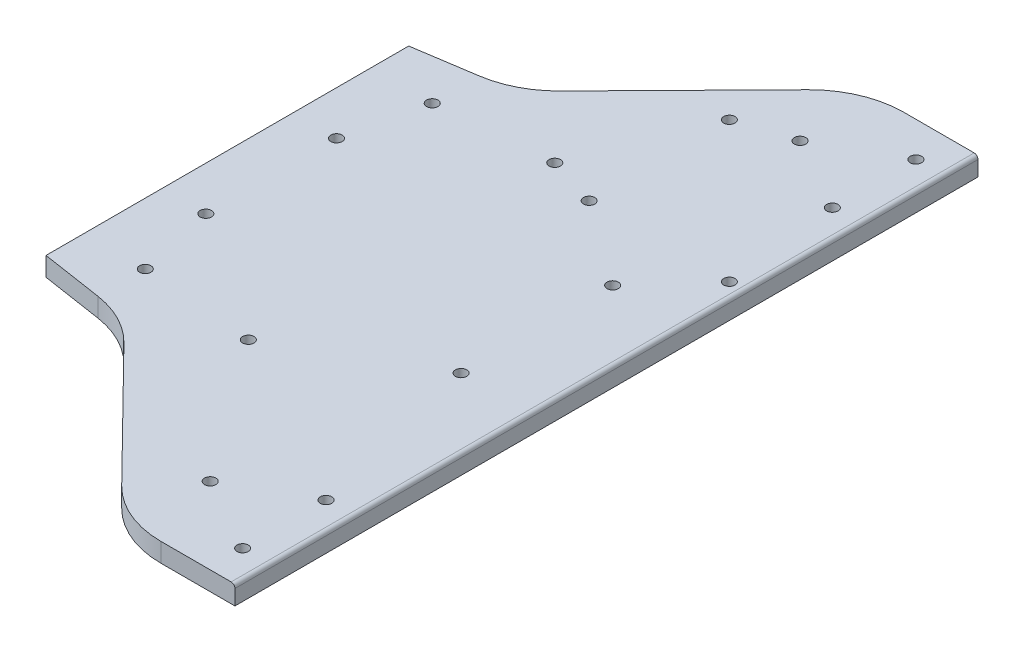
ISO-10303-21;
HEADER;
FILE_DESCRIPTION(('STEP AP214'),'2;1');
FILE_NAME('part.step','',(''),(''),'','','');
FILE_SCHEMA(('AUTOMOTIVE_DESIGN { 1 0 10303 214 1 1 1 1 }'));
ENDSEC;
DATA;
#1=APPLICATION_CONTEXT('core data for automotive mechanical design processes');
#2=APPLICATION_PROTOCOL_DEFINITION('international standard','automotive_design',2000,#1);
#3=PRODUCT_CONTEXT('',#1,'mechanical');
#4=PRODUCT('Part','Part','',(#3));
#5=PRODUCT_RELATED_PRODUCT_CATEGORY('part','',(#4));
#6=PRODUCT_DEFINITION_FORMATION('','',#4);
#7=PRODUCT_DEFINITION_CONTEXT('part definition',#1,'design');
#8=PRODUCT_DEFINITION('design','',#6,#7);
#9=PRODUCT_DEFINITION_SHAPE('','',#8);
#10=(LENGTH_UNIT() NAMED_UNIT(*) SI_UNIT(.MILLI.,.METRE.));
#11=(NAMED_UNIT(*) PLANE_ANGLE_UNIT() SI_UNIT($,.RADIAN.));
#12=(NAMED_UNIT(*) SI_UNIT($,.STERADIAN.) SOLID_ANGLE_UNIT());
#13=UNCERTAINTY_MEASURE_WITH_UNIT(LENGTH_MEASURE(1.E-05),#10,'distance_accuracy_value','');
#14=(GEOMETRIC_REPRESENTATION_CONTEXT(3) GLOBAL_UNCERTAINTY_ASSIGNED_CONTEXT((#13)) GLOBAL_UNIT_ASSIGNED_CONTEXT((#10,
#11,#12)) REPRESENTATION_CONTEXT('',''));
#15=CARTESIAN_POINT('',(0.,0.,0.));
#16=DIRECTION('',(0.,0.,1.));
#17=DIRECTION('',(1.,0.,0.));
#18=AXIS2_PLACEMENT_3D('',#15,#16,#17);
#19=CARTESIAN_POINT('',(100.,0.,0.));
#20=DIRECTION('',(1.,0.,0.));
#21=DIRECTION('',(0.,0.,-1.));
#22=AXIS2_PLACEMENT_3D('',#19,#20,#21);
#23=PLANE('',#22);
#24=DIRECTION('',(0.,1.,0.));
#25=VECTOR('',#24,1.);
#26=CARTESIAN_POINT('',(100.,5.,-47.8337365303758));
#27=LINE('',#26,#25);
#28=CARTESIAN_POINT('',(100.,0.,-47.8337365303758));
#29=VERTEX_POINT('',#28);
#30=CARTESIAN_POINT('',(100.,5.,-47.8337365303758));
#31=VERTEX_POINT('',#30);
#32=EDGE_CURVE('E44',#29,#31,#27,.T.);
#33=ORIENTED_EDGE('',*,*,#32,.F.);
#34=DIRECTION('',(0.,0.,1.));
#35=VECTOR('',#34,1.);
#36=CARTESIAN_POINT('',(100.,0.,73.));
#37=LINE('',#36,#35);
#38=CARTESIAN_POINT('',(100.,0.,47.8337365303758));
#39=VERTEX_POINT('',#38);
#40=EDGE_CURVE('E11',#29,#39,#37,.T.);
#41=ORIENTED_EDGE('',*,*,#40,.T.);
#42=DIRECTION('',(0.,-1.,0.));
#43=VECTOR('',#42,1.);
#44=CARTESIAN_POINT('',(100.,5.,47.8337365303758));
#45=LINE('',#44,#43);
#46=CARTESIAN_POINT('',(100.,5.,47.8337365303758));
#47=VERTEX_POINT('',#46);
#48=EDGE_CURVE('E52',#47,#39,#45,.T.);
#49=ORIENTED_EDGE('',*,*,#48,.F.);
#50=DIRECTION('',(0.,0.,1.));
#51=VECTOR('',#50,1.);
#52=CARTESIAN_POINT('',(100.,5.,73.));
#53=LINE('',#52,#51);
#54=EDGE_CURVE('E39',#31,#47,#53,.T.);
#55=ORIENTED_EDGE('',*,*,#54,.F.);
#56=EDGE_LOOP('',(#33,#41,#49,#55));
#57=FACE_BOUND('',#56,.T.);
#58=ADVANCED_FACE('F36',(#57),#23,.F.);
#59=CARTESIAN_POINT('',(200.,5.,-98.));
#60=DIRECTION('',(-1.,0.,0.));
#61=DIRECTION('',(0.,0.,1.));
#62=AXIS2_PLACEMENT_3D('',#59,#60,#61);
#63=PLANE('',#62);
#64=DIRECTION('',(0.,-1.,0.));
#65=VECTOR('',#64,1.);
#66=CARTESIAN_POINT('',(200.,5.,-98.));
#67=LINE('',#66,#65);
#68=CARTESIAN_POINT('',(200.,4.,-98.));
#69=VERTEX_POINT('',#68);
#70=CARTESIAN_POINT('',(200.,0.,-98.));
#71=VERTEX_POINT('',#70);
#72=EDGE_CURVE('E152',#69,#71,#67,.T.);
#73=ORIENTED_EDGE('',*,*,#72,.F.);
#74=DIRECTION('',(0.,0.,-1.));
#75=VECTOR('',#74,1.);
#76=CARTESIAN_POINT('',(200.,4.,-98.));
#77=LINE('',#76,#75);
#78=CARTESIAN_POINT('',(200.,4.,98.));
#79=VERTEX_POINT('',#78);
#80=EDGE_CURVE('E226',#69,#79,#77,.F.);
#81=ORIENTED_EDGE('',*,*,#80,.T.);
#82=DIRECTION('',(0.,-1.,0.));
#83=VECTOR('',#82,1.);
#84=CARTESIAN_POINT('',(200.,5.,98.));
#85=LINE('',#84,#83);
#86=CARTESIAN_POINT('',(200.,0.,98.));
#87=VERTEX_POINT('',#86);
#88=EDGE_CURVE('E177',#79,#87,#85,.T.);
#89=ORIENTED_EDGE('',*,*,#88,.T.);
#90=DIRECTION('',(0.,0.,-1.));
#91=VECTOR('',#90,1.);
#92=CARTESIAN_POINT('',(200.,0.,-98.));
#93=LINE('',#92,#91);
#94=EDGE_CURVE('E178',#87,#71,#93,.T.);
#95=ORIENTED_EDGE('',*,*,#94,.T.);
#96=EDGE_LOOP('',(#73,#81,#89,#95));
#97=FACE_BOUND('',#96,.T.);
#98=ADVANCED_FACE('F314',(#97),#63,.F.);
#99=CARTESIAN_POINT('',(200.,5.,-98.));
#100=DIRECTION('',(0.,0.,1.));
#101=DIRECTION('',(1.,0.,0.));
#102=AXIS2_PLACEMENT_3D('',#99,#100,#101);
#103=PLANE('',#102);
#104=DIRECTION('',(-1.,0.,0.));
#105=VECTOR('',#104,1.);
#106=CARTESIAN_POINT('',(200.,5.,-98.));
#107=LINE('',#106,#105);
#108=CARTESIAN_POINT('',(199.,5.,-98.));
#109=VERTEX_POINT('',#108);
#110=CARTESIAN_POINT('',(180.486918987026,5.,-98.));
#111=VERTEX_POINT('',#110);
#112=EDGE_CURVE('E132',#109,#111,#107,.T.);
#113=ORIENTED_EDGE('',*,*,#112,.F.);
#114=CARTESIAN_POINT('',(199.,4.,-98.));
#115=DIRECTION('',(0.,0.,1.));
#116=DIRECTION('',(1.,0.,0.));
#117=AXIS2_PLACEMENT_3D('',#114,#115,#116);
#118=CIRCLE('',#117,1.);
#119=EDGE_CURVE('E224',#109,#69,#118,.F.);
#120=ORIENTED_EDGE('',*,*,#119,.T.);
#121=ORIENTED_EDGE('',*,*,#72,.T.);
#122=DIRECTION('',(-1.,0.,0.));
#123=VECTOR('',#122,1.);
#124=CARTESIAN_POINT('',(200.,0.,-98.));
#125=LINE('',#124,#123);
#126=CARTESIAN_POINT('',(180.486918987026,0.,-98.));
#127=VERTEX_POINT('',#126);
#128=EDGE_CURVE('E149',#71,#127,#125,.T.);
#129=ORIENTED_EDGE('',*,*,#128,.T.);
#130=DIRECTION('',(0.,-1.,0.));
#131=VECTOR('',#130,1.);
#132=CARTESIAN_POINT('',(180.486918987026,5.,-98.));
#133=LINE('',#132,#131);
#134=EDGE_CURVE('E146',#111,#127,#133,.T.);
#135=ORIENTED_EDGE('',*,*,#134,.F.);
#136=EDGE_LOOP('',(#113,#120,#121,#129,#135));
#137=FACE_BOUND('',#136,.T.);
#138=ADVANCED_FACE('F147',(#137),#103,.F.);
#139=CARTESIAN_POINT('',(180.486918987026,5.,-73.));
#140=DIRECTION('',(0.,-1.,0.));
#141=DIRECTION('',(0.,0.,-1.));
#142=AXIS2_PLACEMENT_3D('',#139,#140,#141);
#143=CYLINDRICAL_SURFACE('',#142,25.);
#144=CARTESIAN_POINT('',(180.486918987026,0.,-73.));
#145=DIRECTION('',(0.,1.,0.));
#146=DIRECTION('',(0.,0.,1.));
#147=AXIS2_PLACEMENT_3D('',#144,#145,#146);
#148=CIRCLE('',#147,25.);
#149=CARTESIAN_POINT('',(162.651427502353,0.,-90.5184258282579));
#150=VERTEX_POINT('',#149);
#151=EDGE_CURVE('E183',#127,#150,#148,.T.);
#152=ORIENTED_EDGE('',*,*,#151,.T.);
#153=DIRECTION('',(0.,-1.,0.));
#154=VECTOR('',#153,1.);
#155=CARTESIAN_POINT('',(162.651427502353,5.,-90.5184258282579));
#156=LINE('',#155,#154);
#157=CARTESIAN_POINT('',(162.651427502353,5.,-90.5184258282579));
#158=VERTEX_POINT('',#157);
#159=EDGE_CURVE('E153',#158,#150,#156,.T.);
#160=ORIENTED_EDGE('',*,*,#159,.F.);
#161=CARTESIAN_POINT('',(180.486918987026,5.,-73.));
#162=DIRECTION('',(0.,1.,0.));
#163=DIRECTION('',(0.,0.,1.));
#164=AXIS2_PLACEMENT_3D('',#161,#162,#163);
#165=CIRCLE('',#164,25.);
#166=EDGE_CURVE('E137',#111,#158,#165,.T.);
#167=ORIENTED_EDGE('',*,*,#166,.F.);
#168=ORIENTED_EDGE('',*,*,#134,.T.);
#169=EDGE_LOOP('',(#152,#160,#167,#168));
#170=FACE_BOUND('',#169,.T.);
#171=ADVANCED_FACE('F155',(#170),#143,.T.);
#172=CARTESIAN_POINT('',(162.651427502353,5.,-90.5184258282579));
#173=DIRECTION('',(0.713419659386898,0.,0.700737033130319));
#174=DIRECTION('',(0.700737033130319,0.,-0.713419659386898));
#175=AXIS2_PLACEMENT_3D('',#172,#173,#174);
#176=PLANE('',#175);
#177=DIRECTION('',(-0.700737033130319,0.,0.713419659386898));
#178=VECTOR('',#177,1.);
#179=CARTESIAN_POINT('',(162.651427502353,0.,-90.5184258282579));
#180=LINE('',#179,#178);
#181=CARTESIAN_POINT('',(130.227508241499,0.,-57.5076666683875));
#182=VERTEX_POINT('',#181);
#183=EDGE_CURVE('E185',#150,#182,#180,.T.);
#184=ORIENTED_EDGE('',*,*,#183,.T.);
#185=DIRECTION('',(0.,-1.,0.));
#186=VECTOR('',#185,1.);
#187=CARTESIAN_POINT('',(130.227508241499,5.,-57.5076666683875));
#188=LINE('',#187,#186);
#189=CARTESIAN_POINT('',(130.227508241499,5.,-57.5076666683875));
#190=VERTEX_POINT('',#189);
#191=EDGE_CURVE('E218',#190,#182,#188,.T.);
#192=ORIENTED_EDGE('',*,*,#191,.F.);
#193=DIRECTION('',(-0.700737033130319,0.,0.713419659386898));
#194=VECTOR('',#193,1.);
#195=CARTESIAN_POINT('',(162.651427502353,5.,-90.5184258282579));
#196=LINE('',#195,#194);
#197=EDGE_CURVE('E158',#158,#190,#196,.T.);
#198=ORIENTED_EDGE('',*,*,#197,.F.);
#199=ORIENTED_EDGE('',*,*,#159,.T.);
#200=EDGE_LOOP('',(#184,#192,#198,#199));
#201=FACE_BOUND('',#200,.T.);
#202=ADVANCED_FACE('F304',(#201),#176,.F.);
#203=CARTESIAN_POINT('',(112.392016756826,5.,-75.0260924966454));
#204=DIRECTION('',(0.,-1.,0.));
#205=DIRECTION('',(0.,0.,-1.));
#206=AXIS2_PLACEMENT_3D('',#203,#204,#205);
#207=CYLINDRICAL_SURFACE('',#206,25.);
#208=CARTESIAN_POINT('',(112.392016756826,0.,-75.0260924966454));
#209=DIRECTION('',(0.,-1.,0.));
#210=DIRECTION('',(0.,0.,1.));
#211=AXIS2_PLACEMENT_3D('',#208,#209,#210);
#212=CIRCLE('',#211,25.);
#213=CARTESIAN_POINT('',(116.181163828613,0.,-50.3149135594038));
#214=VERTEX_POINT('',#213);
#215=EDGE_CURVE('E187',#182,#214,#212,.T.);
#216=ORIENTED_EDGE('',*,*,#215,.T.);
#217=DIRECTION('',(0.,-1.,0.));
#218=VECTOR('',#217,1.);
#219=CARTESIAN_POINT('',(116.181163828613,5.,-50.3149135594038));
#220=LINE('',#219,#218);
#221=CARTESIAN_POINT('',(116.181163828613,5.,-50.3149135594038));
#222=VERTEX_POINT('',#221);
#223=EDGE_CURVE('E215',#222,#214,#220,.T.);
#224=ORIENTED_EDGE('',*,*,#223,.F.);
#225=CARTESIAN_POINT('',(112.392016756826,5.,-75.0260924966454));
#226=DIRECTION('',(0.,-1.,0.));
#227=DIRECTION('',(0.,0.,1.));
#228=AXIS2_PLACEMENT_3D('',#225,#226,#227);
#229=CIRCLE('',#228,25.);
#230=EDGE_CURVE('E160',#190,#222,#229,.T.);
#231=ORIENTED_EDGE('',*,*,#230,.F.);
#232=ORIENTED_EDGE('',*,*,#191,.T.);
#233=EDGE_LOOP('',(#216,#224,#231,#232));
#234=FACE_BOUND('',#233,.T.);
#235=ADVANCED_FACE('F298',(#234),#207,.F.);
#236=CARTESIAN_POINT('',(116.181163828613,5.,-50.3149135594038));
#237=DIRECTION('',(0.151565882871454,0.,0.988447157489664));
#238=DIRECTION('',(0.988447157489664,0.,-0.151565882871454));
#239=AXIS2_PLACEMENT_3D('',#236,#237,#238);
#240=PLANE('',#239);
#241=DIRECTION('',(-0.988447157489664,0.,0.151565882871454));
#242=VECTOR('',#241,1.);
#243=CARTESIAN_POINT('',(116.181163828613,0.,-50.3149135594038));
#244=LINE('',#243,#242);
#245=EDGE_CURVE('E189',#214,#29,#244,.T.);
#246=ORIENTED_EDGE('',*,*,#245,.T.);
#247=ORIENTED_EDGE('',*,*,#32,.T.);
#248=DIRECTION('',(-0.988447157489664,0.,0.151565882871454));
#249=VECTOR('',#248,1.);
#250=CARTESIAN_POINT('',(116.181163828613,5.,-50.3149135594038));
#251=LINE('',#250,#249);
#252=EDGE_CURVE('E165',#222,#31,#251,.T.);
#253=ORIENTED_EDGE('',*,*,#252,.F.);
#254=ORIENTED_EDGE('',*,*,#223,.T.);
#255=EDGE_LOOP('',(#246,#247,#253,#254));
#256=FACE_BOUND('',#255,.T.);
#257=ADVANCED_FACE('F292',(#256),#240,.F.);
#258=CARTESIAN_POINT('',(116.181163828613,5.,50.3149135594038));
#259=DIRECTION('',(0.151565882871454,0.,-0.988447157489664));
#260=DIRECTION('',(-0.988447157489664,0.,-0.151565882871454));
#261=AXIS2_PLACEMENT_3D('',#258,#259,#260);
#262=PLANE('',#261);
#263=DIRECTION('',(0.988447157489664,0.,0.151565882871454));
#264=VECTOR('',#263,1.);
#265=CARTESIAN_POINT('',(116.181163828613,5.,50.3149135594038));
#266=LINE('',#265,#264);
#267=CARTESIAN_POINT('',(116.181163828613,5.,50.3149135594038));
#268=VERTEX_POINT('',#267);
#269=EDGE_CURVE('E167',#47,#268,#266,.T.);
#270=ORIENTED_EDGE('',*,*,#269,.F.);
#271=ORIENTED_EDGE('',*,*,#48,.T.);
#272=DIRECTION('',(0.988447157489664,0.,0.151565882871454));
#273=VECTOR('',#272,1.);
#274=CARTESIAN_POINT('',(116.181163828613,0.,50.3149135594038));
#275=LINE('',#274,#273);
#276=CARTESIAN_POINT('',(116.181163828613,0.,50.3149135594038));
#277=VERTEX_POINT('',#276);
#278=EDGE_CURVE('E192',#39,#277,#275,.T.);
#279=ORIENTED_EDGE('',*,*,#278,.T.);
#280=DIRECTION('',(0.,-1.,0.));
#281=VECTOR('',#280,1.);
#282=CARTESIAN_POINT('',(116.181163828613,5.,50.3149135594038));
#283=LINE('',#282,#281);
#284=EDGE_CURVE('E212',#268,#277,#283,.T.);
#285=ORIENTED_EDGE('',*,*,#284,.F.);
#286=EDGE_LOOP('',(#270,#271,#279,#285));
#287=FACE_BOUND('',#286,.T.);
#288=ADVANCED_FACE('F411',(#287),#262,.F.);
#289=CARTESIAN_POINT('',(112.392016756826,5.,75.0260924966454));
#290=DIRECTION('',(0.,-1.,0.));
#291=DIRECTION('',(0.,0.,-1.));
#292=AXIS2_PLACEMENT_3D('',#289,#290,#291);
#293=CYLINDRICAL_SURFACE('',#292,25.);
#294=CARTESIAN_POINT('',(112.392016756826,0.,75.0260924966454));
#295=DIRECTION('',(0.,-1.,0.));
#296=DIRECTION('',(0.,0.,-1.));
#297=AXIS2_PLACEMENT_3D('',#294,#295,#296);
#298=CIRCLE('',#297,25.);
#299=CARTESIAN_POINT('',(130.227508241499,0.,57.5076666683875));
#300=VERTEX_POINT('',#299);
#301=EDGE_CURVE('E194',#277,#300,#298,.T.);
#302=ORIENTED_EDGE('',*,*,#301,.T.);
#303=DIRECTION('',(0.,-1.,0.));
#304=VECTOR('',#303,1.);
#305=CARTESIAN_POINT('',(130.227508241499,5.,57.5076666683875));
#306=LINE('',#305,#304);
#307=CARTESIAN_POINT('',(130.227508241499,5.,57.5076666683875));
#308=VERTEX_POINT('',#307);
#309=EDGE_CURVE('E209',#308,#300,#306,.T.);
#310=ORIENTED_EDGE('',*,*,#309,.F.);
#311=CARTESIAN_POINT('',(112.392016756826,5.,75.0260924966454));
#312=DIRECTION('',(0.,-1.,0.));
#313=DIRECTION('',(0.,0.,-1.));
#314=AXIS2_PLACEMENT_3D('',#311,#312,#313);
#315=CIRCLE('',#314,25.);
#316=EDGE_CURVE('E169',#268,#308,#315,.T.);
#317=ORIENTED_EDGE('',*,*,#316,.F.);
#318=ORIENTED_EDGE('',*,*,#284,.T.);
#319=EDGE_LOOP('',(#302,#310,#317,#318));
#320=FACE_BOUND('',#319,.T.);
#321=ADVANCED_FACE('F407',(#320),#293,.F.);
#322=CARTESIAN_POINT('',(162.651427502353,5.,90.5184258282579));
#323=DIRECTION('',(0.713419659386898,0.,-0.700737033130319));
#324=DIRECTION('',(-0.700737033130319,0.,-0.713419659386898));
#325=AXIS2_PLACEMENT_3D('',#322,#323,#324);
#326=PLANE('',#325);
#327=DIRECTION('',(0.700737033130319,0.,0.713419659386898));
#328=VECTOR('',#327,1.);
#329=CARTESIAN_POINT('',(162.651427502353,0.,90.5184258282579));
#330=LINE('',#329,#328);
#331=CARTESIAN_POINT('',(162.651427502353,0.,90.5184258282579));
#332=VERTEX_POINT('',#331);
#333=EDGE_CURVE('E196',#300,#332,#330,.T.);
#334=ORIENTED_EDGE('',*,*,#333,.T.);
#335=DIRECTION('',(0.,-1.,0.));
#336=VECTOR('',#335,1.);
#337=CARTESIAN_POINT('',(162.651427502353,5.,90.5184258282579));
#338=LINE('',#337,#336);
#339=CARTESIAN_POINT('',(162.651427502353,5.,90.5184258282579));
#340=VERTEX_POINT('',#339);
#341=EDGE_CURVE('E206',#340,#332,#338,.T.);
#342=ORIENTED_EDGE('',*,*,#341,.F.);
#343=DIRECTION('',(0.700737033130319,0.,0.713419659386898));
#344=VECTOR('',#343,1.);
#345=CARTESIAN_POINT('',(162.651427502353,5.,90.5184258282579));
#346=LINE('',#345,#344);
#347=EDGE_CURVE('E171',#308,#340,#346,.T.);
#348=ORIENTED_EDGE('',*,*,#347,.F.);
#349=ORIENTED_EDGE('',*,*,#309,.T.);
#350=EDGE_LOOP('',(#334,#342,#348,#349));
#351=FACE_BOUND('',#350,.T.);
#352=ADVANCED_FACE('F403',(#351),#326,.F.);
#353=CARTESIAN_POINT('',(180.486918987026,5.,73.));
#354=DIRECTION('',(0.,-1.,0.));
#355=DIRECTION('',(0.,0.,-1.));
#356=AXIS2_PLACEMENT_3D('',#353,#354,#355);
#357=CYLINDRICAL_SURFACE('',#356,25.);
#358=CARTESIAN_POINT('',(180.486918987026,0.,73.));
#359=DIRECTION('',(0.,1.,0.));
#360=DIRECTION('',(0.,0.,-1.));
#361=AXIS2_PLACEMENT_3D('',#358,#359,#360);
#362=CIRCLE('',#361,25.);
#363=CARTESIAN_POINT('',(180.486918987026,0.,98.));
#364=VERTEX_POINT('',#363);
#365=EDGE_CURVE('E198',#332,#364,#362,.T.);
#366=ORIENTED_EDGE('',*,*,#365,.T.);
#367=DIRECTION('',(0.,-1.,0.));
#368=VECTOR('',#367,1.);
#369=CARTESIAN_POINT('',(180.486918987026,5.,98.));
#370=LINE('',#369,#368);
#371=CARTESIAN_POINT('',(180.486918987026,5.,98.));
#372=VERTEX_POINT('',#371);
#373=EDGE_CURVE('E203',#372,#364,#370,.T.);
#374=ORIENTED_EDGE('',*,*,#373,.F.);
#375=CARTESIAN_POINT('',(180.486918987026,5.,73.));
#376=DIRECTION('',(0.,1.,0.));
#377=DIRECTION('',(0.,0.,-1.));
#378=AXIS2_PLACEMENT_3D('',#375,#376,#377);
#379=CIRCLE('',#378,25.);
#380=EDGE_CURVE('E173',#340,#372,#379,.T.);
#381=ORIENTED_EDGE('',*,*,#380,.F.);
#382=ORIENTED_EDGE('',*,*,#341,.T.);
#383=EDGE_LOOP('',(#366,#374,#381,#382));
#384=FACE_BOUND('',#383,.T.);
#385=ADVANCED_FACE('F399',(#384),#357,.T.);
#386=CARTESIAN_POINT('',(200.,5.,98.));
#387=DIRECTION('',(0.,0.,-1.));
#388=DIRECTION('',(-1.,0.,0.));
#389=AXIS2_PLACEMENT_3D('',#386,#387,#388);
#390=PLANE('',#389);
#391=ORIENTED_EDGE('',*,*,#88,.F.);
#392=CARTESIAN_POINT('',(199.,4.,98.));
#393=DIRECTION('',(0.,0.,-1.));
#394=DIRECTION('',(-1.,0.,0.));
#395=AXIS2_PLACEMENT_3D('',#392,#393,#394);
#396=CIRCLE('',#395,1.);
#397=CARTESIAN_POINT('',(199.,5.,98.));
#398=VERTEX_POINT('',#397);
#399=EDGE_CURVE('E228',#79,#398,#396,.F.);
#400=ORIENTED_EDGE('',*,*,#399,.T.);
#401=DIRECTION('',(1.,0.,0.));
#402=VECTOR('',#401,1.);
#403=CARTESIAN_POINT('',(200.,5.,98.));
#404=LINE('',#403,#402);
#405=EDGE_CURVE('E175',#372,#398,#404,.T.);
#406=ORIENTED_EDGE('',*,*,#405,.F.);
#407=ORIENTED_EDGE('',*,*,#373,.T.);
#408=DIRECTION('',(1.,0.,0.));
#409=VECTOR('',#408,1.);
#410=CARTESIAN_POINT('',(200.,0.,98.));
#411=LINE('',#410,#409);
#412=EDGE_CURVE('E143',#364,#87,#411,.T.);
#413=ORIENTED_EDGE('',*,*,#412,.T.);
#414=EDGE_LOOP('',(#391,#400,#406,#407,#413));
#415=FACE_BOUND('',#414,.T.);
#416=ADVANCED_FACE('F393',(#415),#390,.F.);
#417=CARTESIAN_POINT('',(180.486918987026,5.,73.));
#418=DIRECTION('',(0.,-1.,0.));
#419=DIRECTION('',(0.,0.,-1.));
#420=AXIS2_PLACEMENT_3D('',#417,#418,#419);
#421=PLANE('',#420);
#422=CARTESIAN_POINT('',(116.197121488742,5.,37.8459190863797));
#423=DIRECTION('',(0.,1.,0.));
#424=DIRECTION('',(0.,0.,-1.));
#425=AXIS2_PLACEMENT_3D('',#422,#423,#424);
#426=CIRCLE('',#425,1.5);
#427=CARTESIAN_POINT('',(116.197121488742,5.,36.3459190863797));
#428=VERTEX_POINT('',#427);
#429=EDGE_CURVE('E613',#428,#428,#426,.T.);
#430=ORIENTED_EDGE('',*,*,#429,.F.);
#431=EDGE_LOOP('',(#430));
#432=FACE_BOUND('',#431,.T.);
#433=CARTESIAN_POINT('',(111.560590500053,5.,-17.2314439170671));
#434=DIRECTION('',(0.,1.,0.));
#435=DIRECTION('',(0.,0.,1.));
#436=AXIS2_PLACEMENT_3D('',#433,#434,#435);
#437=CIRCLE('',#436,1.5);
#438=CARTESIAN_POINT('',(111.560590500053,5.,-15.7314439170671));
#439=VERTEX_POINT('',#438);
#440=EDGE_CURVE('E610',#439,#439,#437,.T.);
#441=ORIENTED_EDGE('',*,*,#440,.F.);
#442=EDGE_LOOP('',(#441));
#443=FACE_BOUND('',#442,.T.);
#444=CARTESIAN_POINT('',(116.197121488742,5.,-37.8459190863797));
#445=DIRECTION('',(0.,1.,0.));
#446=DIRECTION('',(0.,0.,1.));
#447=AXIS2_PLACEMENT_3D('',#444,#445,#446);
#448=CIRCLE('',#447,1.5);
#449=CARTESIAN_POINT('',(116.197121488742,5.,-36.3459190863797));
#450=VERTEX_POINT('',#449);
#451=EDGE_CURVE('E279',#450,#450,#448,.T.);
#452=ORIENTED_EDGE('',*,*,#451,.F.);
#453=EDGE_LOOP('',(#452));
#454=FACE_BOUND('',#453,.T.);
#455=CARTESIAN_POINT('',(111.560590500053,5.,17.2314439170671));
#456=DIRECTION('',(0.,1.,0.));
#457=DIRECTION('',(0.,0.,-1.));
#458=AXIS2_PLACEMENT_3D('',#455,#456,#457);
#459=CIRCLE('',#458,1.5);
#460=CARTESIAN_POINT('',(111.560590500053,5.,15.7314439170671));
#461=VERTEX_POINT('',#460);
#462=EDGE_CURVE('E608',#461,#461,#459,.T.);
#463=ORIENTED_EDGE('',*,*,#462,.F.);
#464=EDGE_LOOP('',(#463));
#465=FACE_BOUND('',#464,.T.);
#466=CARTESIAN_POINT('',(196.148923390512,5.,-36.2745744637224));
#467=DIRECTION('',(0.,1.,0.));
#468=DIRECTION('',(0.,0.,1.));
#469=AXIS2_PLACEMENT_3D('',#466,#467,#468);
#470=CIRCLE('',#469,1.5);
#471=CARTESIAN_POINT('',(196.148923390512,5.,-34.7745744637224));
#472=VERTEX_POINT('',#471);
#473=EDGE_CURVE('E268',#472,#472,#470,.T.);
#474=ORIENTED_EDGE('',*,*,#473,.F.);
#475=EDGE_LOOP('',(#474));
#476=FACE_BOUND('',#475,.T.);
#477=CARTESIAN_POINT('',(159.148923390512,5.,-73.2745744637224));
#478=DIRECTION('',(0.,1.,0.));
#479=DIRECTION('',(0.,0.,1.));
#480=AXIS2_PLACEMENT_3D('',#477,#478,#479);
#481=CIRCLE('',#480,1.5);
#482=CARTESIAN_POINT('',(159.148923390512,5.,-71.7745744637224));
#483=VERTEX_POINT('',#482);
#484=EDGE_CURVE('E622',#483,#483,#481,.T.);
#485=ORIENTED_EDGE('',*,*,#484,.F.);
#486=EDGE_LOOP('',(#485));
#487=FACE_BOUND('',#486,.T.);
#488=CARTESIAN_POINT('',(159.148923390512,5.,-36.2745744637224));
#489=DIRECTION('',(0.,1.,0.));
#490=DIRECTION('',(0.,0.,1.));
#491=AXIS2_PLACEMENT_3D('',#488,#489,#490);
#492=CIRCLE('',#491,1.5);
#493=CARTESIAN_POINT('',(159.148923390512,5.,-34.7745744637224));
#494=VERTEX_POINT('',#493);
#495=EDGE_CURVE('E287',#494,#494,#492,.T.);
#496=ORIENTED_EDGE('',*,*,#495,.F.);
#497=EDGE_LOOP('',(#496));
#498=FACE_BOUND('',#497,.T.);
#499=CARTESIAN_POINT('',(145.949264841339,5.,-40.4144793143746));
#500=DIRECTION('',(0.,1.,0.));
#501=DIRECTION('',(0.,0.,1.));
#502=AXIS2_PLACEMENT_3D('',#499,#500,#501);
#503=CIRCLE('',#502,1.5);
#504=CARTESIAN_POINT('',(145.949264841339,5.,-38.9144793143746));
#505=VERTEX_POINT('',#504);
#506=EDGE_CURVE('E260',#505,#505,#503,.T.);
#507=ORIENTED_EDGE('',*,*,#506,.F.);
#508=EDGE_LOOP('',(#507));
#509=FACE_BOUND('',#508,.T.);
#510=CARTESIAN_POINT('',(145.949264841339,5.,40.4144793143746));
#511=DIRECTION('',(0.,1.,0.));
#512=DIRECTION('',(0.,0.,-1.));
#513=AXIS2_PLACEMENT_3D('',#510,#511,#512);
#514=CIRCLE('',#513,1.5);
#515=CARTESIAN_POINT('',(145.949264841339,5.,38.9144793143746));
#516=VERTEX_POINT('',#515);
#517=EDGE_CURVE('E274',#516,#516,#514,.T.);
#518=ORIENTED_EDGE('',*,*,#517,.F.);
#519=EDGE_LOOP('',(#518));
#520=FACE_BOUND('',#519,.T.);
#521=CARTESIAN_POINT('',(181.582963716056,5.,-20.060076368016));
#522=DIRECTION('',(0.,1.,0.));
#523=DIRECTION('',(0.,0.,1.));
#524=AXIS2_PLACEMENT_3D('',#521,#522,#523);
#525=CIRCLE('',#524,1.5);
#526=CARTESIAN_POINT('',(181.582963716056,5.,-18.560076368016));
#527=VERTEX_POINT('',#526);
#528=EDGE_CURVE('E252',#527,#527,#525,.T.);
#529=ORIENTED_EDGE('',*,*,#528,.F.);
#530=EDGE_LOOP('',(#529));
#531=FACE_BOUND('',#530,.T.);
#532=CARTESIAN_POINT('',(181.630257519634,5.,19.9776671429349));
#533=DIRECTION('',(0.,1.,0.));
#534=DIRECTION('',(0.,0.,1.));
#535=AXIS2_PLACEMENT_3D('',#532,#533,#534);
#536=CIRCLE('',#535,1.5);
#537=CARTESIAN_POINT('',(181.630257519634,5.,21.4776671429349));
#538=VERTEX_POINT('',#537);
#539=EDGE_CURVE('E263',#538,#538,#536,.T.);
#540=ORIENTED_EDGE('',*,*,#539,.F.);
#541=EDGE_LOOP('',(#540));
#542=FACE_BOUND('',#541,.T.);
#543=CARTESIAN_POINT('',(192.82460970357,5.,88.8047596551945));
#544=DIRECTION('',(0.,1.,0.));
#545=DIRECTION('',(0.,0.,1.));
#546=AXIS2_PLACEMENT_3D('',#543,#544,#545);
#547=CIRCLE('',#546,1.49813162184624);
#548=CARTESIAN_POINT('',(192.82460970357,5.,90.3028912770407));
#549=VERTEX_POINT('',#548);
#550=EDGE_CURVE('E638',#549,#549,#547,.T.);
#551=ORIENTED_EDGE('',*,*,#550,.F.);
#552=EDGE_LOOP('',(#551));
#553=FACE_BOUND('',#552,.T.);
#554=CARTESIAN_POINT('',(173.269117950926,5.,77.7913863008308));
#555=DIRECTION('',(0.,1.,0.));
#556=DIRECTION('',(0.,0.,1.));
#557=AXIS2_PLACEMENT_3D('',#554,#555,#556);
#558=CIRCLE('',#557,1.50323989008253);
#559=CARTESIAN_POINT('',(173.269117950926,5.,79.2946261909133));
#560=VERTEX_POINT('',#559);
#561=EDGE_CURVE('E641',#560,#560,#558,.T.);
#562=ORIENTED_EDGE('',*,*,#561,.F.);
#563=EDGE_LOOP('',(#562));
#564=FACE_BOUND('',#563,.T.);
#565=CARTESIAN_POINT('',(173.269117950926,5.,-77.7913863008307));
#566=DIRECTION('',(0.,1.,0.));
#567=DIRECTION('',(0.,0.,-1.));
#568=AXIS2_PLACEMENT_3D('',#565,#566,#567);
#569=CIRCLE('',#568,1.50323989008256);
#570=CARTESIAN_POINT('',(173.269117950926,5.,-79.2946261909133));
#571=VERTEX_POINT('',#570);
#572=EDGE_CURVE('E644',#571,#571,#569,.T.);
#573=ORIENTED_EDGE('',*,*,#572,.F.);
#574=EDGE_LOOP('',(#573));
#575=FACE_BOUND('',#574,.T.);
#576=CARTESIAN_POINT('',(192.82460970357,5.,-88.8047596551944));
#577=DIRECTION('',(0.,1.,0.));
#578=DIRECTION('',(0.,0.,-1.));
#579=AXIS2_PLACEMENT_3D('',#576,#577,#578);
#580=CIRCLE('',#579,1.49813162184624);
#581=CARTESIAN_POINT('',(192.82460970357,5.,-90.3028912770407));
#582=VERTEX_POINT('',#581);
#583=EDGE_CURVE('E637',#582,#582,#580,.T.);
#584=ORIENTED_EDGE('',*,*,#583,.F.);
#585=EDGE_LOOP('',(#584));
#586=FACE_BOUND('',#585,.T.);
#587=CARTESIAN_POINT('',(192.80126811493,5.,-66.778012946467));
#588=DIRECTION('',(0.,1.,0.));
#589=DIRECTION('',(0.,0.,-1.));
#590=AXIS2_PLACEMENT_3D('',#587,#588,#589);
#591=CIRCLE('',#590,1.50384733367598);
#592=CARTESIAN_POINT('',(192.80126811493,5.,-68.281860280143));
#593=VERTEX_POINT('',#592);
#594=EDGE_CURVE('E255',#593,#593,#591,.T.);
#595=ORIENTED_EDGE('',*,*,#594,.F.);
#596=EDGE_LOOP('',(#595));
#597=FACE_BOUND('',#596,.T.);
#598=CARTESIAN_POINT('',(192.80126811493,5.,66.7780129464671));
#599=DIRECTION('',(0.,1.,0.));
#600=DIRECTION('',(0.,0.,1.));
#601=AXIS2_PLACEMENT_3D('',#598,#599,#600);
#602=CIRCLE('',#601,1.50384733367595);
#603=CARTESIAN_POINT('',(192.80126811493,5.,68.281860280143));
#604=VERTEX_POINT('',#603);
#605=EDGE_CURVE('E234',#604,#604,#602,.T.);
#606=ORIENTED_EDGE('',*,*,#605,.F.);
#607=EDGE_LOOP('',(#606));
#608=FACE_BOUND('',#607,.T.);
#609=ORIENTED_EDGE('',*,*,#252,.T.);
#610=ORIENTED_EDGE('',*,*,#54,.T.);
#611=ORIENTED_EDGE('',*,*,#269,.T.);
#612=ORIENTED_EDGE('',*,*,#316,.T.);
#613=ORIENTED_EDGE('',*,*,#347,.T.);
#614=ORIENTED_EDGE('',*,*,#380,.T.);
#615=ORIENTED_EDGE('',*,*,#405,.T.);
#616=DIRECTION('',(0.,0.,-1.));
#617=VECTOR('',#616,1.);
#618=CARTESIAN_POINT('',(199.,5.,73.));
#619=LINE('',#618,#617);
#620=EDGE_CURVE('E141',#398,#109,#619,.T.);
#621=ORIENTED_EDGE('',*,*,#620,.T.);
#622=ORIENTED_EDGE('',*,*,#112,.T.);
#623=ORIENTED_EDGE('',*,*,#166,.T.);
#624=ORIENTED_EDGE('',*,*,#197,.T.);
#625=ORIENTED_EDGE('',*,*,#230,.T.);
#626=EDGE_LOOP('',(#609,#610,#611,#612,#613,#614,#615,#621,#622,#623,#624,#625));
#627=FACE_BOUND('',#626,.T.);
#628=ADVANCED_FACE('F135',(#432,#443,#454,#465,#476,#487,#498,#509,#520,#531,#542,#553,#564,
#575,#586,#597,#608,#627),#421,.F.);
#629=CARTESIAN_POINT('',(180.486918987026,0.,73.));
#630=DIRECTION('',(0.,-1.,0.));
#631=DIRECTION('',(0.,0.,-1.));
#632=AXIS2_PLACEMENT_3D('',#629,#630,#631);
#633=PLANE('',#632);
#634=ORIENTED_EDGE('',*,*,#40,.F.);
#635=ORIENTED_EDGE('',*,*,#245,.F.);
#636=ORIENTED_EDGE('',*,*,#215,.F.);
#637=ORIENTED_EDGE('',*,*,#183,.F.);
#638=ORIENTED_EDGE('',*,*,#151,.F.);
#639=ORIENTED_EDGE('',*,*,#128,.F.);
#640=ORIENTED_EDGE('',*,*,#94,.F.);
#641=ORIENTED_EDGE('',*,*,#412,.F.);
#642=ORIENTED_EDGE('',*,*,#365,.F.);
#643=ORIENTED_EDGE('',*,*,#333,.F.);
#644=ORIENTED_EDGE('',*,*,#301,.F.);
#645=ORIENTED_EDGE('',*,*,#278,.F.);
#646=EDGE_LOOP('',(#634,#635,#636,#637,#638,#639,#640,#641,#642,#643,#644,#645));
#647=FACE_BOUND('',#646,.T.);
#648=CARTESIAN_POINT('',(116.197121488742,0.,37.8459190863797));
#649=DIRECTION('',(0.,-1.,0.));
#650=DIRECTION('',(0.,0.,-1.));
#651=AXIS2_PLACEMENT_3D('',#648,#649,#650);
#652=CIRCLE('',#651,1.5);
#653=CARTESIAN_POINT('',(116.197121488742,0.,36.3459190863797));
#654=VERTEX_POINT('',#653);
#655=EDGE_CURVE('E285',#654,#654,#652,.T.);
#656=ORIENTED_EDGE('',*,*,#655,.F.);
#657=EDGE_LOOP('',(#656));
#658=FACE_BOUND('',#657,.T.);
#659=CARTESIAN_POINT('',(111.560590500053,0.,-17.2314439170671));
#660=DIRECTION('',(0.,-1.,0.));
#661=DIRECTION('',(0.,0.,-1.));
#662=AXIS2_PLACEMENT_3D('',#659,#660,#661);
#663=CIRCLE('',#662,1.5);
#664=CARTESIAN_POINT('',(111.560590500053,0.,-18.7314439170671));
#665=VERTEX_POINT('',#664);
#666=EDGE_CURVE('E282',#665,#665,#663,.T.);
#667=ORIENTED_EDGE('',*,*,#666,.F.);
#668=EDGE_LOOP('',(#667));
#669=FACE_BOUND('',#668,.T.);
#670=CARTESIAN_POINT('',(116.197121488742,0.,-37.8459190863797));
#671=DIRECTION('',(0.,-1.,0.));
#672=DIRECTION('',(0.,0.,-1.));
#673=AXIS2_PLACEMENT_3D('',#670,#671,#672);
#674=CIRCLE('',#673,1.5);
#675=CARTESIAN_POINT('',(116.197121488742,0.,-39.3459190863797));
#676=VERTEX_POINT('',#675);
#677=EDGE_CURVE('E278',#676,#676,#674,.T.);
#678=ORIENTED_EDGE('',*,*,#677,.F.);
#679=EDGE_LOOP('',(#678));
#680=FACE_BOUND('',#679,.T.);
#681=CARTESIAN_POINT('',(111.560590500053,0.,17.2314439170671));
#682=DIRECTION('',(0.,-1.,0.));
#683=DIRECTION('',(0.,0.,-1.));
#684=AXIS2_PLACEMENT_3D('',#681,#682,#683);
#685=CIRCLE('',#684,1.5);
#686=CARTESIAN_POINT('',(111.560590500053,0.,15.7314439170671));
#687=VERTEX_POINT('',#686);
#688=EDGE_CURVE('E275',#687,#687,#685,.T.);
#689=ORIENTED_EDGE('',*,*,#688,.F.);
#690=EDGE_LOOP('',(#689));
#691=FACE_BOUND('',#690,.T.);
#692=CARTESIAN_POINT('',(196.148923390512,0.,-36.2745744637224));
#693=DIRECTION('',(0.,-1.,0.));
#694=DIRECTION('',(0.,0.,-1.));
#695=AXIS2_PLACEMENT_3D('',#692,#693,#694);
#696=CIRCLE('',#695,1.5);
#697=CARTESIAN_POINT('',(196.148923390512,0.,-37.7745744637224));
#698=VERTEX_POINT('',#697);
#699=EDGE_CURVE('E271',#698,#698,#696,.T.);
#700=ORIENTED_EDGE('',*,*,#699,.F.);
#701=EDGE_LOOP('',(#700));
#702=FACE_BOUND('',#701,.T.);
#703=CARTESIAN_POINT('',(159.148923390512,0.,-73.2745744637224));
#704=DIRECTION('',(0.,-1.,0.));
#705=DIRECTION('',(0.,0.,-1.));
#706=AXIS2_PLACEMENT_3D('',#703,#704,#705);
#707=CIRCLE('',#706,1.5);
#708=CARTESIAN_POINT('',(159.148923390512,0.,-74.7745744637224));
#709=VERTEX_POINT('',#708);
#710=EDGE_CURVE('E267',#709,#709,#707,.T.);
#711=ORIENTED_EDGE('',*,*,#710,.F.);
#712=EDGE_LOOP('',(#711));
#713=FACE_BOUND('',#712,.T.);
#714=CARTESIAN_POINT('',(159.148923390512,0.,-36.2745744637224));
#715=DIRECTION('',(0.,-1.,0.));
#716=DIRECTION('',(0.,0.,-1.));
#717=AXIS2_PLACEMENT_3D('',#714,#715,#716);
#718=CIRCLE('',#717,1.5);
#719=CARTESIAN_POINT('',(159.148923390512,0.,-37.7745744637224));
#720=VERTEX_POINT('',#719);
#721=EDGE_CURVE('E264',#720,#720,#718,.T.);
#722=ORIENTED_EDGE('',*,*,#721,.F.);
#723=EDGE_LOOP('',(#722));
#724=FACE_BOUND('',#723,.T.);
#725=CARTESIAN_POINT('',(145.949264841339,0.,-40.4144793143746));
#726=DIRECTION('',(0.,-1.,0.));
#727=DIRECTION('',(0.,0.,-1.));
#728=AXIS2_PLACEMENT_3D('',#725,#726,#727);
#729=CIRCLE('',#728,1.5);
#730=CARTESIAN_POINT('',(145.949264841339,0.,-41.9144793143746));
#731=VERTEX_POINT('',#730);
#732=EDGE_CURVE('E259',#731,#731,#729,.T.);
#733=ORIENTED_EDGE('',*,*,#732,.F.);
#734=EDGE_LOOP('',(#733));
#735=FACE_BOUND('',#734,.T.);
#736=CARTESIAN_POINT('',(145.949264841339,0.,40.4144793143746));
#737=DIRECTION('',(0.,-1.,0.));
#738=DIRECTION('',(0.,0.,-1.));
#739=AXIS2_PLACEMENT_3D('',#736,#737,#738);
#740=CIRCLE('',#739,1.5);
#741=CARTESIAN_POINT('',(145.949264841339,0.,38.9144793143746));
#742=VERTEX_POINT('',#741);
#743=EDGE_CURVE('E256',#742,#742,#740,.T.);
#744=ORIENTED_EDGE('',*,*,#743,.F.);
#745=EDGE_LOOP('',(#744));
#746=FACE_BOUND('',#745,.T.);
#747=CARTESIAN_POINT('',(181.582963716056,0.,-20.060076368016));
#748=DIRECTION('',(0.,-1.,0.));
#749=DIRECTION('',(0.,0.,-1.));
#750=AXIS2_PLACEMENT_3D('',#747,#748,#749);
#751=CIRCLE('',#750,1.5);
#752=CARTESIAN_POINT('',(181.582963716056,0.,-21.560076368016));
#753=VERTEX_POINT('',#752);
#754=EDGE_CURVE('E251',#753,#753,#751,.T.);
#755=ORIENTED_EDGE('',*,*,#754,.F.);
#756=EDGE_LOOP('',(#755));
#757=FACE_BOUND('',#756,.T.);
#758=CARTESIAN_POINT('',(181.630257519634,0.,19.9776671429349));
#759=DIRECTION('',(0.,-1.,0.));
#760=DIRECTION('',(0.,0.,-1.));
#761=AXIS2_PLACEMENT_3D('',#758,#759,#760);
#762=CIRCLE('',#761,1.5);
#763=CARTESIAN_POINT('',(181.630257519634,0.,18.4776671429349));
#764=VERTEX_POINT('',#763);
#765=EDGE_CURVE('E248',#764,#764,#762,.T.);
#766=ORIENTED_EDGE('',*,*,#765,.F.);
#767=EDGE_LOOP('',(#766));
#768=FACE_BOUND('',#767,.T.);
#769=CARTESIAN_POINT('',(192.82460970357,0.,88.8047596551945));
#770=DIRECTION('',(0.,-1.,0.));
#771=DIRECTION('',(0.,0.,-1.));
#772=AXIS2_PLACEMENT_3D('',#769,#770,#771);
#773=CIRCLE('',#772,1.49813162184624);
#774=CARTESIAN_POINT('',(192.82460970357,0.,87.3066280333482));
#775=VERTEX_POINT('',#774);
#776=EDGE_CURVE('E181',#775,#775,#773,.T.);
#777=ORIENTED_EDGE('',*,*,#776,.F.);
#778=EDGE_LOOP('',(#777));
#779=FACE_BOUND('',#778,.T.);
#780=CARTESIAN_POINT('',(173.269117950926,0.,77.7913863008308));
#781=DIRECTION('',(0.,-1.,0.));
#782=DIRECTION('',(0.,0.,-1.));
#783=AXIS2_PLACEMENT_3D('',#780,#781,#782);
#784=CIRCLE('',#783,1.50323989008253);
#785=CARTESIAN_POINT('',(173.269117950926,0.,76.2881464107482));
#786=VERTEX_POINT('',#785);
#787=EDGE_CURVE('E243',#786,#786,#784,.T.);
#788=ORIENTED_EDGE('',*,*,#787,.F.);
#789=EDGE_LOOP('',(#788));
#790=FACE_BOUND('',#789,.T.);
#791=CARTESIAN_POINT('',(173.269117950926,0.,-77.7913863008307));
#792=DIRECTION('',(0.,-1.,0.));
#793=DIRECTION('',(0.,0.,-1.));
#794=AXIS2_PLACEMENT_3D('',#791,#792,#793);
#795=CIRCLE('',#794,1.50323989008256);
#796=CARTESIAN_POINT('',(173.269117950926,0.,-79.2946261909133));
#797=VERTEX_POINT('',#796);
#798=EDGE_CURVE('E240',#797,#797,#795,.T.);
#799=ORIENTED_EDGE('',*,*,#798,.F.);
#800=EDGE_LOOP('',(#799));
#801=FACE_BOUND('',#800,.T.);
#802=CARTESIAN_POINT('',(192.82460970357,0.,-88.8047596551944));
#803=DIRECTION('',(0.,-1.,0.));
#804=DIRECTION('',(0.,0.,-1.));
#805=AXIS2_PLACEMENT_3D('',#802,#803,#804);
#806=CIRCLE('',#805,1.49813162184624);
#807=CARTESIAN_POINT('',(192.82460970357,0.,-90.3028912770407));
#808=VERTEX_POINT('',#807);
#809=EDGE_CURVE('E237',#808,#808,#806,.T.);
#810=ORIENTED_EDGE('',*,*,#809,.F.);
#811=EDGE_LOOP('',(#810));
#812=FACE_BOUND('',#811,.T.);
#813=CARTESIAN_POINT('',(192.80126811493,0.,-66.778012946467));
#814=DIRECTION('',(0.,-1.,0.));
#815=DIRECTION('',(0.,0.,-1.));
#816=AXIS2_PLACEMENT_3D('',#813,#814,#815);
#817=CIRCLE('',#816,1.50384733367598);
#818=CARTESIAN_POINT('',(192.80126811493,0.,-68.281860280143));
#819=VERTEX_POINT('',#818);
#820=EDGE_CURVE('E233',#819,#819,#817,.T.);
#821=ORIENTED_EDGE('',*,*,#820,.F.);
#822=EDGE_LOOP('',(#821));
#823=FACE_BOUND('',#822,.T.);
#824=CARTESIAN_POINT('',(192.80126811493,0.,66.7780129464671));
#825=DIRECTION('',(0.,-1.,0.));
#826=DIRECTION('',(0.,0.,-1.));
#827=AXIS2_PLACEMENT_3D('',#824,#825,#826);
#828=CIRCLE('',#827,1.50384733367595);
#829=CARTESIAN_POINT('',(192.80126811493,0.,65.2741656127911));
#830=VERTEX_POINT('',#829);
#831=EDGE_CURVE('E230',#830,#830,#828,.T.);
#832=ORIENTED_EDGE('',*,*,#831,.F.);
#833=EDGE_LOOP('',(#832));
#834=FACE_BOUND('',#833,.T.);
#835=ADVANCED_FACE('F300',(#647,#658,#669,#680,#691,#702,#713,#724,#735,#746,#757,#768,#779,
#790,#801,#812,#823,#834),#633,.T.);
#836=CARTESIAN_POINT('',(199.,4.,73.));
#837=DIRECTION('',(0.,0.,-1.));
#838=DIRECTION('',(-1.,0.,0.));
#839=AXIS2_PLACEMENT_3D('',#836,#837,#838);
#840=CYLINDRICAL_SURFACE('',#839,1.);
#841=ORIENTED_EDGE('',*,*,#399,.F.);
#842=ORIENTED_EDGE('',*,*,#80,.F.);
#843=ORIENTED_EDGE('',*,*,#119,.F.);
#844=ORIENTED_EDGE('',*,*,#620,.F.);
#845=EDGE_LOOP('',(#841,#842,#843,#844));
#846=FACE_BOUND('',#845,.T.);
#847=ADVANCED_FACE('F389',(#846),#840,.T.);
#848=CARTESIAN_POINT('',(192.80126811493,-5.,66.7780129464671));
#849=DIRECTION('',(0.,1.,0.));
#850=DIRECTION('',(0.,0.,1.));
#851=AXIS2_PLACEMENT_3D('',#848,#849,#850);
#852=CYLINDRICAL_SURFACE('',#851,1.50384733367595);
#853=ORIENTED_EDGE('',*,*,#831,.T.);
#854=EDGE_LOOP('',(#853));
#855=FACE_BOUND('',#854,.T.);
#856=ORIENTED_EDGE('',*,*,#605,.T.);
#857=EDGE_LOOP('',(#856));
#858=FACE_BOUND('',#857,.T.);
#859=ADVANCED_FACE('F371',(#855,#858),#852,.F.);
#860=CARTESIAN_POINT('',(192.80126811493,-5.,-66.778012946467));
#861=DIRECTION('',(0.,1.,0.));
#862=DIRECTION('',(0.,0.,1.));
#863=AXIS2_PLACEMENT_3D('',#860,#861,#862);
#864=CYLINDRICAL_SURFACE('',#863,1.50384733367598);
#865=ORIENTED_EDGE('',*,*,#820,.T.);
#866=EDGE_LOOP('',(#865));
#867=FACE_BOUND('',#866,.T.);
#868=ORIENTED_EDGE('',*,*,#594,.T.);
#869=EDGE_LOOP('',(#868));
#870=FACE_BOUND('',#869,.T.);
#871=ADVANCED_FACE('F367',(#867,#870),#864,.F.);
#872=CARTESIAN_POINT('',(192.82460970357,-5.,-88.8047596551944));
#873=DIRECTION('',(0.,1.,0.));
#874=DIRECTION('',(0.,0.,1.));
#875=AXIS2_PLACEMENT_3D('',#872,#873,#874);
#876=CYLINDRICAL_SURFACE('',#875,1.49813162184624);
#877=ORIENTED_EDGE('',*,*,#809,.T.);
#878=EDGE_LOOP('',(#877));
#879=FACE_BOUND('',#878,.T.);
#880=ORIENTED_EDGE('',*,*,#583,.T.);
#881=EDGE_LOOP('',(#880));
#882=FACE_BOUND('',#881,.T.);
#883=ADVANCED_FACE('F370',(#879,#882),#876,.F.);
#884=CARTESIAN_POINT('',(173.269117950926,-5.,-77.7913863008307));
#885=DIRECTION('',(0.,1.,0.));
#886=DIRECTION('',(0.,0.,1.));
#887=AXIS2_PLACEMENT_3D('',#884,#885,#886);
#888=CYLINDRICAL_SURFACE('',#887,1.50323989008256);
#889=ORIENTED_EDGE('',*,*,#798,.T.);
#890=EDGE_LOOP('',(#889));
#891=FACE_BOUND('',#890,.T.);
#892=ORIENTED_EDGE('',*,*,#572,.T.);
#893=EDGE_LOOP('',(#892));
#894=FACE_BOUND('',#893,.T.);
#895=ADVANCED_FACE('F379',(#891,#894),#888,.F.);
#896=CARTESIAN_POINT('',(173.269117950926,-5.,77.7913863008308));
#897=DIRECTION('',(0.,1.,0.));
#898=DIRECTION('',(0.,0.,1.));
#899=AXIS2_PLACEMENT_3D('',#896,#897,#898);
#900=CYLINDRICAL_SURFACE('',#899,1.50323989008253);
#901=ORIENTED_EDGE('',*,*,#787,.T.);
#902=EDGE_LOOP('',(#901));
#903=FACE_BOUND('',#902,.T.);
#904=ORIENTED_EDGE('',*,*,#561,.T.);
#905=EDGE_LOOP('',(#904));
#906=FACE_BOUND('',#905,.T.);
#907=ADVANCED_FACE('F375',(#903,#906),#900,.F.);
#908=CARTESIAN_POINT('',(192.82460970357,-5.,88.8047596551945));
#909=DIRECTION('',(0.,1.,0.));
#910=DIRECTION('',(0.,0.,1.));
#911=AXIS2_PLACEMENT_3D('',#908,#909,#910);
#912=CYLINDRICAL_SURFACE('',#911,1.49813162184624);
#913=ORIENTED_EDGE('',*,*,#776,.T.);
#914=EDGE_LOOP('',(#913));
#915=FACE_BOUND('',#914,.T.);
#916=ORIENTED_EDGE('',*,*,#550,.T.);
#917=EDGE_LOOP('',(#916));
#918=FACE_BOUND('',#917,.T.);
#919=ADVANCED_FACE('F365',(#915,#918),#912,.F.);
#920=CARTESIAN_POINT('',(181.630257519634,-5.,19.9776671429349));
#921=DIRECTION('',(0.,1.,0.));
#922=DIRECTION('',(0.,0.,1.));
#923=AXIS2_PLACEMENT_3D('',#920,#921,#922);
#924=CYLINDRICAL_SURFACE('',#923,1.5);
#925=ORIENTED_EDGE('',*,*,#765,.T.);
#926=EDGE_LOOP('',(#925));
#927=FACE_BOUND('',#926,.T.);
#928=ORIENTED_EDGE('',*,*,#539,.T.);
#929=EDGE_LOOP('',(#928));
#930=FACE_BOUND('',#929,.T.);
#931=ADVANCED_FACE('F361',(#927,#930),#924,.F.);
#932=CARTESIAN_POINT('',(181.582963716056,-5.,-20.060076368016));
#933=DIRECTION('',(0.,1.,0.));
#934=DIRECTION('',(0.,0.,1.));
#935=AXIS2_PLACEMENT_3D('',#932,#933,#934);
#936=CYLINDRICAL_SURFACE('',#935,1.5);
#937=ORIENTED_EDGE('',*,*,#754,.T.);
#938=EDGE_LOOP('',(#937));
#939=FACE_BOUND('',#938,.T.);
#940=ORIENTED_EDGE('',*,*,#528,.T.);
#941=EDGE_LOOP('',(#940));
#942=FACE_BOUND('',#941,.T.);
#943=ADVANCED_FACE('F357',(#939,#942),#936,.F.);
#944=CARTESIAN_POINT('',(145.949264841339,-5.,40.4144793143746));
#945=DIRECTION('',(0.,1.,0.));
#946=DIRECTION('',(0.,0.,1.));
#947=AXIS2_PLACEMENT_3D('',#944,#945,#946);
#948=CYLINDRICAL_SURFACE('',#947,1.5);
#949=ORIENTED_EDGE('',*,*,#743,.T.);
#950=EDGE_LOOP('',(#949));
#951=FACE_BOUND('',#950,.T.);
#952=ORIENTED_EDGE('',*,*,#517,.T.);
#953=EDGE_LOOP('',(#952));
#954=FACE_BOUND('',#953,.T.);
#955=ADVANCED_FACE('F353',(#951,#954),#948,.F.);
#956=CARTESIAN_POINT('',(145.949264841339,-5.,-40.4144793143746));
#957=DIRECTION('',(0.,1.,0.));
#958=DIRECTION('',(0.,0.,1.));
#959=AXIS2_PLACEMENT_3D('',#956,#957,#958);
#960=CYLINDRICAL_SURFACE('',#959,1.5);
#961=ORIENTED_EDGE('',*,*,#732,.T.);
#962=EDGE_LOOP('',(#961));
#963=FACE_BOUND('',#962,.T.);
#964=ORIENTED_EDGE('',*,*,#506,.T.);
#965=EDGE_LOOP('',(#964));
#966=FACE_BOUND('',#965,.T.);
#967=ADVANCED_FACE('F349',(#963,#966),#960,.F.);
#968=CARTESIAN_POINT('',(159.148923390512,-5.,-36.2745744637224));
#969=DIRECTION('',(0.,1.,0.));
#970=DIRECTION('',(0.,0.,1.));
#971=AXIS2_PLACEMENT_3D('',#968,#969,#970);
#972=CYLINDRICAL_SURFACE('',#971,1.5);
#973=ORIENTED_EDGE('',*,*,#721,.T.);
#974=EDGE_LOOP('',(#973));
#975=FACE_BOUND('',#974,.T.);
#976=ORIENTED_EDGE('',*,*,#495,.T.);
#977=EDGE_LOOP('',(#976));
#978=FACE_BOUND('',#977,.T.);
#979=ADVANCED_FACE('F345',(#975,#978),#972,.F.);
#980=CARTESIAN_POINT('',(159.148923390512,-5.,-73.2745744637224));
#981=DIRECTION('',(0.,1.,0.));
#982=DIRECTION('',(0.,0.,1.));
#983=AXIS2_PLACEMENT_3D('',#980,#981,#982);
#984=CYLINDRICAL_SURFACE('',#983,1.5);
#985=ORIENTED_EDGE('',*,*,#710,.T.);
#986=EDGE_LOOP('',(#985));
#987=FACE_BOUND('',#986,.T.);
#988=ORIENTED_EDGE('',*,*,#484,.T.);
#989=EDGE_LOOP('',(#988));
#990=FACE_BOUND('',#989,.T.);
#991=ADVANCED_FACE('F341',(#987,#990),#984,.F.);
#992=CARTESIAN_POINT('',(196.148923390512,-5.,-36.2745744637224));
#993=DIRECTION('',(0.,1.,0.));
#994=DIRECTION('',(0.,0.,1.));
#995=AXIS2_PLACEMENT_3D('',#992,#993,#994);
#996=CYLINDRICAL_SURFACE('',#995,1.5);
#997=ORIENTED_EDGE('',*,*,#699,.T.);
#998=EDGE_LOOP('',(#997));
#999=FACE_BOUND('',#998,.T.);
#1000=ORIENTED_EDGE('',*,*,#473,.T.);
#1001=EDGE_LOOP('',(#1000));
#1002=FACE_BOUND('',#1001,.T.);
#1003=ADVANCED_FACE('F338',(#999,#1002),#996,.F.);
#1004=CARTESIAN_POINT('',(111.560590500053,-5.,17.2314439170671));
#1005=DIRECTION('',(0.,1.,0.));
#1006=DIRECTION('',(0.,0.,1.));
#1007=AXIS2_PLACEMENT_3D('',#1004,#1005,#1006);
#1008=CYLINDRICAL_SURFACE('',#1007,1.5);
#1009=ORIENTED_EDGE('',*,*,#688,.T.);
#1010=EDGE_LOOP('',(#1009));
#1011=FACE_BOUND('',#1010,.T.);
#1012=ORIENTED_EDGE('',*,*,#462,.T.);
#1013=EDGE_LOOP('',(#1012));
#1014=FACE_BOUND('',#1013,.T.);
#1015=ADVANCED_FACE('F336',(#1011,#1014),#1008,.F.);
#1016=CARTESIAN_POINT('',(116.197121488742,-5.,-37.8459190863797));
#1017=DIRECTION('',(0.,1.,0.));
#1018=DIRECTION('',(0.,0.,1.));
#1019=AXIS2_PLACEMENT_3D('',#1016,#1017,#1018);
#1020=CYLINDRICAL_SURFACE('',#1019,1.5);
#1021=ORIENTED_EDGE('',*,*,#677,.T.);
#1022=EDGE_LOOP('',(#1021));
#1023=FACE_BOUND('',#1022,.T.);
#1024=ORIENTED_EDGE('',*,*,#451,.T.);
#1025=EDGE_LOOP('',(#1024));
#1026=FACE_BOUND('',#1025,.T.);
#1027=ADVANCED_FACE('F328',(#1023,#1026),#1020,.F.);
#1028=CARTESIAN_POINT('',(111.560590500053,-5.,-17.2314439170671));
#1029=DIRECTION('',(0.,1.,0.));
#1030=DIRECTION('',(0.,0.,1.));
#1031=AXIS2_PLACEMENT_3D('',#1028,#1029,#1030);
#1032=CYLINDRICAL_SURFACE('',#1031,1.5);
#1033=ORIENTED_EDGE('',*,*,#666,.T.);
#1034=EDGE_LOOP('',(#1033));
#1035=FACE_BOUND('',#1034,.T.);
#1036=ORIENTED_EDGE('',*,*,#440,.T.);
#1037=EDGE_LOOP('',(#1036));
#1038=FACE_BOUND('',#1037,.T.);
#1039=ADVANCED_FACE('F322',(#1035,#1038),#1032,.F.);
#1040=CARTESIAN_POINT('',(116.197121488742,-5.,37.8459190863797));
#1041=DIRECTION('',(0.,1.,0.));
#1042=DIRECTION('',(0.,0.,1.));
#1043=AXIS2_PLACEMENT_3D('',#1040,#1041,#1042);
#1044=CYLINDRICAL_SURFACE('',#1043,1.5);
#1045=ORIENTED_EDGE('',*,*,#655,.T.);
#1046=EDGE_LOOP('',(#1045));
#1047=FACE_BOUND('',#1046,.T.);
#1048=ORIENTED_EDGE('',*,*,#429,.T.);
#1049=EDGE_LOOP('',(#1048));
#1050=FACE_BOUND('',#1049,.T.);
#1051=ADVANCED_FACE('F315',(#1047,#1050),#1044,.F.);
#1052=CLOSED_SHELL('',(#58,#98,#138,#171,#202,#235,#257,#288,#321,#352,#385,#416,#628,#835,#847,
#859,#871,#883,#895,#907,#919,#931,#943,#955,#967,#979,#991,#1003,#1015,#1027,#1039,#1051));
#1053=MANIFOLD_SOLID_BREP('B2',#1052);
#1054=ADVANCED_BREP_SHAPE_REPRESENTATION('',(#18,#1053),#14);
#1055=SHAPE_DEFINITION_REPRESENTATION(#9,#1054);
ENDSEC;
END-ISO-10303-21;
